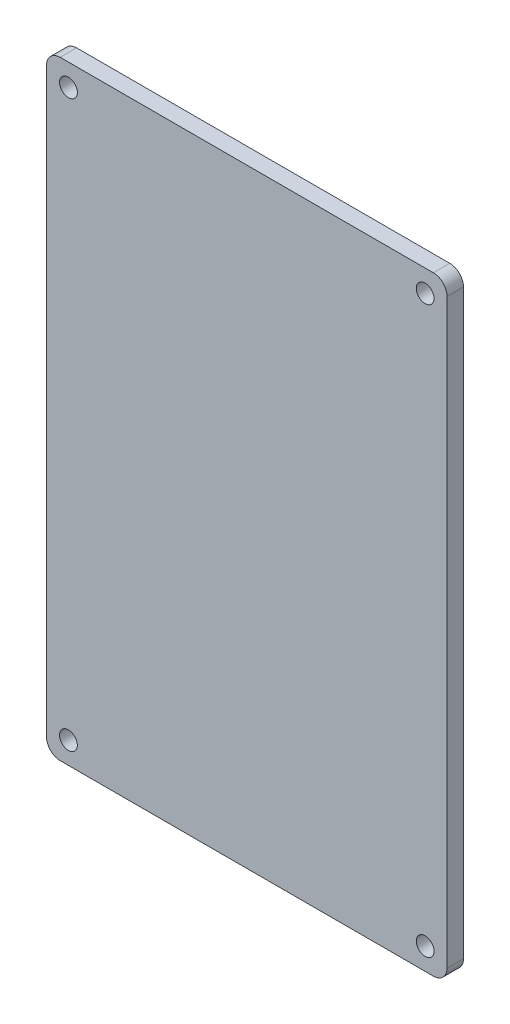
ISO-10303-21;
HEADER;
FILE_DESCRIPTION(('STEP AP214'),'2;1');
FILE_NAME('part.step','',(''),(''),'','','');
FILE_SCHEMA(('AUTOMOTIVE_DESIGN { 1 0 10303 214 1 1 1 1 }'));
ENDSEC;
DATA;
#1=APPLICATION_CONTEXT('core data for automotive mechanical design processes');
#2=APPLICATION_PROTOCOL_DEFINITION('international standard','automotive_design',2000,#1);
#3=PRODUCT_CONTEXT('',#1,'mechanical');
#4=PRODUCT('Part','Part','',(#3));
#5=PRODUCT_RELATED_PRODUCT_CATEGORY('part','',(#4));
#6=PRODUCT_DEFINITION_FORMATION('','',#4);
#7=PRODUCT_DEFINITION_CONTEXT('part definition',#1,'design');
#8=PRODUCT_DEFINITION('design','',#6,#7);
#9=PRODUCT_DEFINITION_SHAPE('','',#8);
#10=(LENGTH_UNIT() NAMED_UNIT(*) SI_UNIT(.MILLI.,.METRE.));
#11=(NAMED_UNIT(*) PLANE_ANGLE_UNIT() SI_UNIT($,.RADIAN.));
#12=(NAMED_UNIT(*) SI_UNIT($,.STERADIAN.) SOLID_ANGLE_UNIT());
#13=UNCERTAINTY_MEASURE_WITH_UNIT(LENGTH_MEASURE(1.E-05),#10,'distance_accuracy_value','');
#14=(GEOMETRIC_REPRESENTATION_CONTEXT(3) GLOBAL_UNCERTAINTY_ASSIGNED_CONTEXT((#13)) GLOBAL_UNIT_ASSIGNED_CONTEXT((#10,
#11,#12)) REPRESENTATION_CONTEXT('',''));
#15=CARTESIAN_POINT('',(0.,0.,0.));
#16=DIRECTION('',(0.,0.,1.));
#17=DIRECTION('',(1.,0.,0.));
#18=AXIS2_PLACEMENT_3D('',#15,#16,#17);
#19=CARTESIAN_POINT('',(2.50184337253552,2.50007812415396,3.));
#20=DIRECTION('',(0.,0.,1.));
#21=DIRECTION('',(1.,0.,0.));
#22=AXIS2_PLACEMENT_3D('',#19,#20,#21);
#23=PLANE('',#22);
#24=CARTESIAN_POINT('',(4.00184337253552,4.00007812415396,3.));
#25=DIRECTION('',(0.,0.,1.));
#26=DIRECTION('',(1.,0.,0.));
#27=AXIS2_PLACEMENT_3D('',#24,#25,#26);
#28=CIRCLE('',#27,1.625);
#29=CARTESIAN_POINT('',(5.62684337253552,4.00007812415396,3.));
#30=VERTEX_POINT('',#29);
#31=EDGE_CURVE('E188',#30,#30,#28,.T.);
#32=ORIENTED_EDGE('',*,*,#31,.F.);
#33=EDGE_LOOP('',(#32));
#34=FACE_BOUND('',#33,.T.);
#35=CARTESIAN_POINT('',(69.1520587725364,107.249885124154,3.));
#36=DIRECTION('',(0.,0.,1.));
#37=DIRECTION('',(1.,0.,0.));
#38=AXIS2_PLACEMENT_3D('',#35,#36,#37);
#39=CIRCLE('',#38,1.625);
#40=CARTESIAN_POINT('',(70.7770587725364,107.249885124154,3.));
#41=VERTEX_POINT('',#40);
#42=EDGE_CURVE('E134',#41,#41,#39,.T.);
#43=ORIENTED_EDGE('',*,*,#42,.F.);
#44=EDGE_LOOP('',(#43));
#45=FACE_BOUND('',#44,.T.);
#46=CARTESIAN_POINT('',(2.50184337253552,2.50007812415396,3.));
#47=DIRECTION('',(0.,0.,1.));
#48=DIRECTION('',(1.,0.,0.));
#49=AXIS2_PLACEMENT_3D('',#46,#47,#48);
#50=CIRCLE('',#49,2.5);
#51=CARTESIAN_POINT('',(0.00184337253551803,2.50007812415396,3.));
#52=VERTEX_POINT('',#51);
#53=CARTESIAN_POINT('',(2.50184337253552,7.81241539598021E-05,3.));
#54=VERTEX_POINT('',#53);
#55=EDGE_CURVE('E148',#52,#54,#50,.T.);
#56=ORIENTED_EDGE('',*,*,#55,.T.);
#57=DIRECTION('',(1.,0.,0.));
#58=VECTOR('',#57,1.);
#59=CARTESIAN_POINT('',(65.1520587725364,7.81241539531408E-05,3.));
#60=LINE('',#59,#58);
#61=CARTESIAN_POINT('',(70.6520587725364,7.8124153958959E-05,3.));
#62=VERTEX_POINT('',#61);
#63=EDGE_CURVE('E91',#54,#62,#60,.T.);
#64=ORIENTED_EDGE('',*,*,#63,.T.);
#65=CARTESIAN_POINT('',(70.6520587725364,2.50007812415395,3.));
#66=DIRECTION('',(0.,0.,1.));
#67=DIRECTION('',(1.,0.,0.));
#68=AXIS2_PLACEMENT_3D('',#65,#66,#67);
#69=CIRCLE('',#68,2.49999999999999);
#70=CARTESIAN_POINT('',(73.1520587725364,2.50007812415395,3.));
#71=VERTEX_POINT('',#70);
#72=EDGE_CURVE('E163',#62,#71,#69,.T.);
#73=ORIENTED_EDGE('',*,*,#72,.T.);
#74=DIRECTION('',(0.,1.,0.));
#75=VECTOR('',#74,1.);
#76=CARTESIAN_POINT('',(73.1520587725364,8.00007812415395,3.));
#77=LINE('',#76,#75);
#78=CARTESIAN_POINT('',(73.1520587725364,108.749885124154,3.));
#79=VERTEX_POINT('',#78);
#80=EDGE_CURVE('E173',#71,#79,#77,.T.);
#81=ORIENTED_EDGE('',*,*,#80,.T.);
#82=CARTESIAN_POINT('',(70.6520587725364,108.749885124154,3.));
#83=DIRECTION('',(0.,0.,1.));
#84=DIRECTION('',(1.,0.,0.));
#85=AXIS2_PLACEMENT_3D('',#82,#83,#84);
#86=CIRCLE('',#85,2.5);
#87=CARTESIAN_POINT('',(70.6520587725364,111.249885124154,3.));
#88=VERTEX_POINT('',#87);
#89=EDGE_CURVE('E111',#79,#88,#86,.T.);
#90=ORIENTED_EDGE('',*,*,#89,.T.);
#91=DIRECTION('',(-1.,0.,0.));
#92=VECTOR('',#91,1.);
#93=CARTESIAN_POINT('',(8.00184337253552,111.249885124154,3.));
#94=LINE('',#93,#92);
#95=CARTESIAN_POINT('',(2.50184337253553,111.249885124154,3.));
#96=VERTEX_POINT('',#95);
#97=EDGE_CURVE('E104',#88,#96,#94,.T.);
#98=ORIENTED_EDGE('',*,*,#97,.T.);
#99=CARTESIAN_POINT('',(2.50184337253553,108.749885124154,3.));
#100=DIRECTION('',(0.,0.,1.));
#101=DIRECTION('',(1.,0.,0.));
#102=AXIS2_PLACEMENT_3D('',#99,#100,#101);
#103=CIRCLE('',#102,2.5);
#104=CARTESIAN_POINT('',(0.00184337253552469,108.749885124154,3.));
#105=VERTEX_POINT('',#104);
#106=EDGE_CURVE('E108',#96,#105,#103,.T.);
#107=ORIENTED_EDGE('',*,*,#106,.T.);
#108=DIRECTION('',(0.,-1.,0.));
#109=VECTOR('',#108,1.);
#110=CARTESIAN_POINT('',(0.00184337253551803,8.00007812415395,3.));
#111=LINE('',#110,#109);
#112=EDGE_CURVE('E50',#105,#52,#111,.T.);
#113=ORIENTED_EDGE('',*,*,#112,.T.);
#114=EDGE_LOOP('',(#56,#64,#73,#81,#90,#98,#107,#113));
#115=FACE_BOUND('',#114,.T.);
#116=CARTESIAN_POINT('',(4.00184337253553,107.249885124154,3.));
#117=DIRECTION('',(0.,0.,1.));
#118=DIRECTION('',(1.,0.,0.));
#119=AXIS2_PLACEMENT_3D('',#116,#117,#118);
#120=CIRCLE('',#119,1.625);
#121=CARTESIAN_POINT('',(5.62684337253553,107.249885124154,3.));
#122=VERTEX_POINT('',#121);
#123=EDGE_CURVE('E182',#122,#122,#120,.T.);
#124=ORIENTED_EDGE('',*,*,#123,.F.);
#125=EDGE_LOOP('',(#124));
#126=FACE_BOUND('',#125,.T.);
#127=CARTESIAN_POINT('',(69.1520587725364,4.00007812415395,3.));
#128=DIRECTION('',(0.,0.,1.));
#129=DIRECTION('',(1.,0.,0.));
#130=AXIS2_PLACEMENT_3D('',#127,#128,#129);
#131=CIRCLE('',#130,1.625);
#132=CARTESIAN_POINT('',(70.7770587725364,4.00007812415395,3.));
#133=VERTEX_POINT('',#132);
#134=EDGE_CURVE('E194',#133,#133,#131,.T.);
#135=ORIENTED_EDGE('',*,*,#134,.F.);
#136=EDGE_LOOP('',(#135));
#137=FACE_BOUND('',#136,.T.);
#138=ADVANCED_FACE('F33',(#34,#45,#115,#126,#137),#23,.T.);
#139=CARTESIAN_POINT('',(2.50184337253552,2.50007812415396,0.));
#140=DIRECTION('',(0.,0.,1.));
#141=DIRECTION('',(1.,0.,0.));
#142=AXIS2_PLACEMENT_3D('',#139,#140,#141);
#143=PLANE('',#142);
#144=CARTESIAN_POINT('',(2.50184337253552,2.50007812415396,0.));
#145=DIRECTION('',(0.,0.,1.));
#146=DIRECTION('',(1.,0.,0.));
#147=AXIS2_PLACEMENT_3D('',#144,#145,#146);
#148=CIRCLE('',#147,2.5);
#149=CARTESIAN_POINT('',(0.00184337253551803,2.50007812415396,0.));
#150=VERTEX_POINT('',#149);
#151=CARTESIAN_POINT('',(2.50184337253552,7.81241539598021E-05,0.));
#152=VERTEX_POINT('',#151);
#153=EDGE_CURVE('E130',#150,#152,#148,.T.);
#154=ORIENTED_EDGE('',*,*,#153,.F.);
#155=DIRECTION('',(0.,-1.,0.));
#156=VECTOR('',#155,1.);
#157=CARTESIAN_POINT('',(0.00184337253551803,8.00007812415395,0.));
#158=LINE('',#157,#156);
#159=CARTESIAN_POINT('',(0.00184337253552469,108.749885124154,0.));
#160=VERTEX_POINT('',#159);
#161=EDGE_CURVE('E79',#160,#150,#158,.T.);
#162=ORIENTED_EDGE('',*,*,#161,.F.);
#163=CARTESIAN_POINT('',(2.50184337253553,108.749885124154,0.));
#164=DIRECTION('',(0.,0.,1.));
#165=DIRECTION('',(1.,0.,0.));
#166=AXIS2_PLACEMENT_3D('',#163,#164,#165);
#167=CIRCLE('',#166,2.5);
#168=CARTESIAN_POINT('',(2.50184337253553,111.249885124154,0.));
#169=VERTEX_POINT('',#168);
#170=EDGE_CURVE('E145',#169,#160,#167,.T.);
#171=ORIENTED_EDGE('',*,*,#170,.F.);
#172=DIRECTION('',(-1.,0.,0.));
#173=VECTOR('',#172,1.);
#174=CARTESIAN_POINT('',(8.00184337253552,111.249885124154,0.));
#175=LINE('',#174,#173);
#176=CARTESIAN_POINT('',(70.6520587725364,111.249885124154,0.));
#177=VERTEX_POINT('',#176);
#178=EDGE_CURVE('E119',#177,#169,#175,.T.);
#179=ORIENTED_EDGE('',*,*,#178,.F.);
#180=CARTESIAN_POINT('',(70.6520587725364,108.749885124154,0.));
#181=DIRECTION('',(0.,0.,1.));
#182=DIRECTION('',(1.,0.,0.));
#183=AXIS2_PLACEMENT_3D('',#180,#181,#182);
#184=CIRCLE('',#183,2.5);
#185=CARTESIAN_POINT('',(73.1520587725364,108.749885124154,0.));
#186=VERTEX_POINT('',#185);
#187=EDGE_CURVE('E141',#186,#177,#184,.T.);
#188=ORIENTED_EDGE('',*,*,#187,.F.);
#189=DIRECTION('',(0.,1.,0.));
#190=VECTOR('',#189,1.);
#191=CARTESIAN_POINT('',(73.1520587725364,8.00007812415395,0.));
#192=LINE('',#191,#190);
#193=CARTESIAN_POINT('',(73.1520587725364,2.50007812415395,0.));
#194=VERTEX_POINT('',#193);
#195=EDGE_CURVE('E139',#194,#186,#192,.T.);
#196=ORIENTED_EDGE('',*,*,#195,.F.);
#197=CARTESIAN_POINT('',(70.6520587725364,2.50007812415395,0.));
#198=DIRECTION('',(0.,0.,1.));
#199=DIRECTION('',(1.,0.,0.));
#200=AXIS2_PLACEMENT_3D('',#197,#198,#199);
#201=CIRCLE('',#200,2.49999999999999);
#202=CARTESIAN_POINT('',(70.6520587725364,7.8124153958959E-05,0.));
#203=VERTEX_POINT('',#202);
#204=EDGE_CURVE('E136',#203,#194,#201,.T.);
#205=ORIENTED_EDGE('',*,*,#204,.F.);
#206=DIRECTION('',(1.,0.,0.));
#207=VECTOR('',#206,1.);
#208=CARTESIAN_POINT('',(65.1520587725364,7.81241539531408E-05,0.));
#209=LINE('',#208,#207);
#210=EDGE_CURVE('E133',#152,#203,#209,.T.);
#211=ORIENTED_EDGE('',*,*,#210,.F.);
#212=EDGE_LOOP('',(#154,#162,#171,#179,#188,#196,#205,#211));
#213=FACE_BOUND('',#212,.T.);
#214=CARTESIAN_POINT('',(69.1520587725364,107.249885124154,0.));
#215=DIRECTION('',(0.,0.,1.));
#216=DIRECTION('',(1.,0.,0.));
#217=AXIS2_PLACEMENT_3D('',#214,#215,#216);
#218=CIRCLE('',#217,1.625);
#219=CARTESIAN_POINT('',(70.7770587725364,107.249885124154,0.));
#220=VERTEX_POINT('',#219);
#221=EDGE_CURVE('E179',#220,#220,#218,.T.);
#222=ORIENTED_EDGE('',*,*,#221,.T.);
#223=EDGE_LOOP('',(#222));
#224=FACE_BOUND('',#223,.T.);
#225=CARTESIAN_POINT('',(4.00184337253553,107.249885124154,0.));
#226=DIRECTION('',(0.,0.,1.));
#227=DIRECTION('',(1.,0.,0.));
#228=AXIS2_PLACEMENT_3D('',#225,#226,#227);
#229=CIRCLE('',#228,1.625);
#230=CARTESIAN_POINT('',(5.62684337253553,107.249885124154,0.));
#231=VERTEX_POINT('',#230);
#232=EDGE_CURVE('E185',#231,#231,#229,.T.);
#233=ORIENTED_EDGE('',*,*,#232,.T.);
#234=EDGE_LOOP('',(#233));
#235=FACE_BOUND('',#234,.T.);
#236=CARTESIAN_POINT('',(4.00184337253552,4.00007812415396,0.));
#237=DIRECTION('',(0.,0.,1.));
#238=DIRECTION('',(1.,0.,0.));
#239=AXIS2_PLACEMENT_3D('',#236,#237,#238);
#240=CIRCLE('',#239,1.625);
#241=CARTESIAN_POINT('',(5.62684337253552,4.00007812415396,0.));
#242=VERTEX_POINT('',#241);
#243=EDGE_CURVE('E191',#242,#242,#240,.T.);
#244=ORIENTED_EDGE('',*,*,#243,.T.);
#245=EDGE_LOOP('',(#244));
#246=FACE_BOUND('',#245,.T.);
#247=CARTESIAN_POINT('',(69.1520587725364,4.00007812415395,0.));
#248=DIRECTION('',(0.,0.,1.));
#249=DIRECTION('',(1.,0.,0.));
#250=AXIS2_PLACEMENT_3D('',#247,#248,#249);
#251=CIRCLE('',#250,1.625);
#252=CARTESIAN_POINT('',(70.7770587725364,4.00007812415395,0.));
#253=VERTEX_POINT('',#252);
#254=EDGE_CURVE('E197',#253,#253,#251,.T.);
#255=ORIENTED_EDGE('',*,*,#254,.T.);
#256=EDGE_LOOP('',(#255));
#257=FACE_BOUND('',#256,.T.);
#258=ADVANCED_FACE('F164',(#213,#224,#235,#246,#257),#143,.F.);
#259=CARTESIAN_POINT('',(2.50184337253552,2.50007812415396,3.));
#260=DIRECTION('',(0.,0.,-1.));
#261=DIRECTION('',(-1.,0.,0.));
#262=AXIS2_PLACEMENT_3D('',#259,#260,#261);
#263=CYLINDRICAL_SURFACE('',#262,2.5);
#264=ORIENTED_EDGE('',*,*,#153,.T.);
#265=DIRECTION('',(0.,0.,-1.));
#266=VECTOR('',#265,1.);
#267=CARTESIAN_POINT('',(2.50184337253552,7.81241539598021E-05,3.));
#268=LINE('',#267,#266);
#269=EDGE_CURVE('E11',#54,#152,#268,.T.);
#270=ORIENTED_EDGE('',*,*,#269,.F.);
#271=ORIENTED_EDGE('',*,*,#55,.F.);
#272=DIRECTION('',(0.,0.,-1.));
#273=VECTOR('',#272,1.);
#274=CARTESIAN_POINT('',(0.00184337253551803,2.50007812415396,3.));
#275=LINE('',#274,#273);
#276=EDGE_CURVE('E126',#52,#150,#275,.T.);
#277=ORIENTED_EDGE('',*,*,#276,.T.);
#278=EDGE_LOOP('',(#264,#270,#271,#277));
#279=FACE_BOUND('',#278,.T.);
#280=ADVANCED_FACE('F35',(#279),#263,.T.);
#281=CARTESIAN_POINT('',(65.1520587725364,7.81241539531408E-05,3.));
#282=DIRECTION('',(0.,1.,0.));
#283=DIRECTION('',(0.,0.,1.));
#284=AXIS2_PLACEMENT_3D('',#281,#282,#283);
#285=PLANE('',#284);
#286=ORIENTED_EDGE('',*,*,#210,.T.);
#287=DIRECTION('',(0.,0.,-1.));
#288=VECTOR('',#287,1.);
#289=CARTESIAN_POINT('',(70.6520587725364,7.8124153958959E-05,3.));
#290=LINE('',#289,#288);
#291=EDGE_CURVE('E42',#62,#203,#290,.T.);
#292=ORIENTED_EDGE('',*,*,#291,.F.);
#293=ORIENTED_EDGE('',*,*,#63,.F.);
#294=ORIENTED_EDGE('',*,*,#269,.T.);
#295=EDGE_LOOP('',(#286,#292,#293,#294));
#296=FACE_BOUND('',#295,.T.);
#297=ADVANCED_FACE('F231',(#296),#285,.F.);
#298=CARTESIAN_POINT('',(70.6520587725364,2.50007812415395,3.));
#299=DIRECTION('',(0.,0.,-1.));
#300=DIRECTION('',(-1.,0.,0.));
#301=AXIS2_PLACEMENT_3D('',#298,#299,#300);
#302=CYLINDRICAL_SURFACE('',#301,2.49999999999999);
#303=ORIENTED_EDGE('',*,*,#204,.T.);
#304=DIRECTION('',(0.,0.,-1.));
#305=VECTOR('',#304,1.);
#306=CARTESIAN_POINT('',(73.1520587725364,2.50007812415395,3.));
#307=LINE('',#306,#305);
#308=EDGE_CURVE('E155',#71,#194,#307,.T.);
#309=ORIENTED_EDGE('',*,*,#308,.F.);
#310=ORIENTED_EDGE('',*,*,#72,.F.);
#311=ORIENTED_EDGE('',*,*,#291,.T.);
#312=EDGE_LOOP('',(#303,#309,#310,#311));
#313=FACE_BOUND('',#312,.T.);
#314=ADVANCED_FACE('F161',(#313),#302,.T.);
#315=CARTESIAN_POINT('',(73.1520587725364,8.00007812415395,3.));
#316=DIRECTION('',(-1.,0.,0.));
#317=DIRECTION('',(0.,0.,1.));
#318=AXIS2_PLACEMENT_3D('',#315,#316,#317);
#319=PLANE('',#318);
#320=ORIENTED_EDGE('',*,*,#195,.T.);
#321=DIRECTION('',(0.,0.,-1.));
#322=VECTOR('',#321,1.);
#323=CARTESIAN_POINT('',(73.1520587725364,108.749885124154,3.));
#324=LINE('',#323,#322);
#325=EDGE_CURVE('E152',#79,#186,#324,.T.);
#326=ORIENTED_EDGE('',*,*,#325,.F.);
#327=ORIENTED_EDGE('',*,*,#80,.F.);
#328=ORIENTED_EDGE('',*,*,#308,.T.);
#329=EDGE_LOOP('',(#320,#326,#327,#328));
#330=FACE_BOUND('',#329,.T.);
#331=ADVANCED_FACE('F169',(#330),#319,.F.);
#332=CARTESIAN_POINT('',(70.6520587725364,108.749885124154,3.));
#333=DIRECTION('',(0.,0.,-1.));
#334=DIRECTION('',(-1.,0.,0.));
#335=AXIS2_PLACEMENT_3D('',#332,#333,#334);
#336=CYLINDRICAL_SURFACE('',#335,2.5);
#337=ORIENTED_EDGE('',*,*,#187,.T.);
#338=DIRECTION('',(0.,0.,-1.));
#339=VECTOR('',#338,1.);
#340=CARTESIAN_POINT('',(70.6520587725364,111.249885124154,3.));
#341=LINE('',#340,#339);
#342=EDGE_CURVE('E121',#88,#177,#341,.T.);
#343=ORIENTED_EDGE('',*,*,#342,.F.);
#344=ORIENTED_EDGE('',*,*,#89,.F.);
#345=ORIENTED_EDGE('',*,*,#325,.T.);
#346=EDGE_LOOP('',(#337,#343,#344,#345));
#347=FACE_BOUND('',#346,.T.);
#348=ADVANCED_FACE('F172',(#347),#336,.T.);
#349=CARTESIAN_POINT('',(8.00184337253552,111.249885124154,3.));
#350=DIRECTION('',(0.,-1.,0.));
#351=DIRECTION('',(0.,0.,-1.));
#352=AXIS2_PLACEMENT_3D('',#349,#350,#351);
#353=PLANE('',#352);
#354=ORIENTED_EDGE('',*,*,#178,.T.);
#355=DIRECTION('',(0.,0.,-1.));
#356=VECTOR('',#355,1.);
#357=CARTESIAN_POINT('',(2.50184337253553,111.249885124154,3.));
#358=LINE('',#357,#356);
#359=EDGE_CURVE('E117',#96,#169,#358,.T.);
#360=ORIENTED_EDGE('',*,*,#359,.F.);
#361=ORIENTED_EDGE('',*,*,#97,.F.);
#362=ORIENTED_EDGE('',*,*,#342,.T.);
#363=EDGE_LOOP('',(#354,#360,#361,#362));
#364=FACE_BOUND('',#363,.T.);
#365=ADVANCED_FACE('F118',(#364),#353,.F.);
#366=CARTESIAN_POINT('',(2.50184337253553,108.749885124154,3.));
#367=DIRECTION('',(0.,0.,-1.));
#368=DIRECTION('',(-1.,0.,0.));
#369=AXIS2_PLACEMENT_3D('',#366,#367,#368);
#370=CYLINDRICAL_SURFACE('',#369,2.5);
#371=ORIENTED_EDGE('',*,*,#170,.T.);
#372=DIRECTION('',(0.,0.,-1.));
#373=VECTOR('',#372,1.);
#374=CARTESIAN_POINT('',(0.00184337253552469,108.749885124154,3.));
#375=LINE('',#374,#373);
#376=EDGE_CURVE('E122',#105,#160,#375,.T.);
#377=ORIENTED_EDGE('',*,*,#376,.F.);
#378=ORIENTED_EDGE('',*,*,#106,.F.);
#379=ORIENTED_EDGE('',*,*,#359,.T.);
#380=EDGE_LOOP('',(#371,#377,#378,#379));
#381=FACE_BOUND('',#380,.T.);
#382=ADVANCED_FACE('F124',(#381),#370,.T.);
#383=CARTESIAN_POINT('',(0.00184337253551803,8.00007812415395,3.));
#384=DIRECTION('',(1.,0.,0.));
#385=DIRECTION('',(0.,0.,-1.));
#386=AXIS2_PLACEMENT_3D('',#383,#384,#385);
#387=PLANE('',#386);
#388=ORIENTED_EDGE('',*,*,#161,.T.);
#389=ORIENTED_EDGE('',*,*,#276,.F.);
#390=ORIENTED_EDGE('',*,*,#112,.F.);
#391=ORIENTED_EDGE('',*,*,#376,.T.);
#392=EDGE_LOOP('',(#388,#389,#390,#391));
#393=FACE_BOUND('',#392,.T.);
#394=ADVANCED_FACE('F219',(#393),#387,.F.);
#395=CARTESIAN_POINT('',(69.1520587725364,107.249885124154,3.));
#396=DIRECTION('',(0.,0.,-1.));
#397=DIRECTION('',(-1.,0.,0.));
#398=AXIS2_PLACEMENT_3D('',#395,#396,#397);
#399=CYLINDRICAL_SURFACE('',#398,1.625);
#400=ORIENTED_EDGE('',*,*,#42,.T.);
#401=EDGE_LOOP('',(#400));
#402=FACE_BOUND('',#401,.T.);
#403=ORIENTED_EDGE('',*,*,#221,.F.);
#404=EDGE_LOOP('',(#403));
#405=FACE_BOUND('',#404,.T.);
#406=ADVANCED_FACE('F216',(#402,#405),#399,.F.);
#407=CARTESIAN_POINT('',(4.00184337253553,107.249885124154,3.));
#408=DIRECTION('',(0.,0.,-1.));
#409=DIRECTION('',(-1.,0.,0.));
#410=AXIS2_PLACEMENT_3D('',#407,#408,#409);
#411=CYLINDRICAL_SURFACE('',#410,1.625);
#412=ORIENTED_EDGE('',*,*,#123,.T.);
#413=EDGE_LOOP('',(#412));
#414=FACE_BOUND('',#413,.T.);
#415=ORIENTED_EDGE('',*,*,#232,.F.);
#416=EDGE_LOOP('',(#415));
#417=FACE_BOUND('',#416,.T.);
#418=ADVANCED_FACE('F307',(#414,#417),#411,.F.);
#419=CARTESIAN_POINT('',(4.00184337253552,4.00007812415396,3.));
#420=DIRECTION('',(0.,0.,-1.));
#421=DIRECTION('',(-1.,0.,0.));
#422=AXIS2_PLACEMENT_3D('',#419,#420,#421);
#423=CYLINDRICAL_SURFACE('',#422,1.625);
#424=ORIENTED_EDGE('',*,*,#31,.T.);
#425=EDGE_LOOP('',(#424));
#426=FACE_BOUND('',#425,.T.);
#427=ORIENTED_EDGE('',*,*,#243,.F.);
#428=EDGE_LOOP('',(#427));
#429=FACE_BOUND('',#428,.T.);
#430=ADVANCED_FACE('F315',(#426,#429),#423,.F.);
#431=CARTESIAN_POINT('',(69.1520587725364,4.00007812415395,3.));
#432=DIRECTION('',(0.,0.,-1.));
#433=DIRECTION('',(-1.,0.,0.));
#434=AXIS2_PLACEMENT_3D('',#431,#432,#433);
#435=CYLINDRICAL_SURFACE('',#434,1.625);
#436=ORIENTED_EDGE('',*,*,#134,.T.);
#437=EDGE_LOOP('',(#436));
#438=FACE_BOUND('',#437,.T.);
#439=ORIENTED_EDGE('',*,*,#254,.F.);
#440=EDGE_LOOP('',(#439));
#441=FACE_BOUND('',#440,.T.);
#442=ADVANCED_FACE('F203',(#438,#441),#435,.F.);
#443=CLOSED_SHELL('',(#138,#258,#280,#297,#314,#331,#348,#365,#382,#394,#406,#418,#430,#442));
#444=MANIFOLD_SOLID_BREP('B2',#443);
#445=ADVANCED_BREP_SHAPE_REPRESENTATION('',(#18,#444),#14);
#446=SHAPE_DEFINITION_REPRESENTATION(#9,#445);
ENDSEC;
END-ISO-10303-21;
